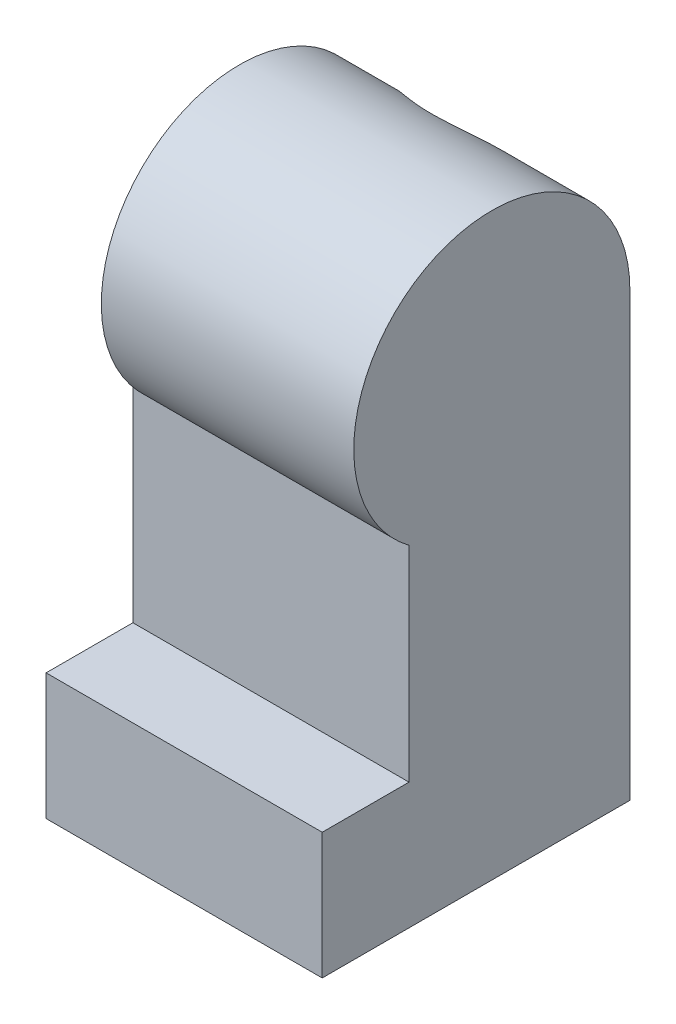
ISO-10303-21;
HEADER;
FILE_DESCRIPTION(('STEP AP214'),'2;1');
FILE_NAME('part.step','',(''),(''),'','','');
FILE_SCHEMA(('AUTOMOTIVE_DESIGN { 1 0 10303 214 1 1 1 1 }'));
ENDSEC;
DATA;
#1=APPLICATION_CONTEXT('core data for automotive mechanical design processes');
#2=APPLICATION_PROTOCOL_DEFINITION('international standard','automotive_design',2000,#1);
#3=PRODUCT_CONTEXT('',#1,'mechanical');
#4=PRODUCT('Part','Part','',(#3));
#5=PRODUCT_RELATED_PRODUCT_CATEGORY('part','',(#4));
#6=PRODUCT_DEFINITION_FORMATION('','',#4);
#7=PRODUCT_DEFINITION_CONTEXT('part definition',#1,'design');
#8=PRODUCT_DEFINITION('design','',#6,#7);
#9=PRODUCT_DEFINITION_SHAPE('','',#8);
#10=(LENGTH_UNIT() NAMED_UNIT(*) SI_UNIT(.MILLI.,.METRE.));
#11=(NAMED_UNIT(*) PLANE_ANGLE_UNIT() SI_UNIT($,.RADIAN.));
#12=(NAMED_UNIT(*) SI_UNIT($,.STERADIAN.) SOLID_ANGLE_UNIT());
#13=UNCERTAINTY_MEASURE_WITH_UNIT(LENGTH_MEASURE(1.E-05),#10,'distance_accuracy_value','');
#14=(GEOMETRIC_REPRESENTATION_CONTEXT(3) GLOBAL_UNCERTAINTY_ASSIGNED_CONTEXT((#13)) GLOBAL_UNIT_ASSIGNED_CONTEXT((#10,
#11,#12)) REPRESENTATION_CONTEXT('',''));
#15=CARTESIAN_POINT('',(0.,0.,0.));
#16=DIRECTION('',(0.,0.,1.));
#17=DIRECTION('',(1.,0.,0.));
#18=AXIS2_PLACEMENT_3D('',#15,#16,#17);
#19=CARTESIAN_POINT('',(-3.5,0.499999999999999,-1.7));
#20=DIRECTION('',(0.,0.,-1.));
#21=DIRECTION('',(0.,1.,0.));
#22=AXIS2_PLACEMENT_3D('',#19,#20,#21);
#23=PLANE('',#22);
#24=DIRECTION('',(-1.,0.,0.));
#25=VECTOR('',#24,1.);
#26=CARTESIAN_POINT('',(0.,2.2,-1.7));
#27=LINE('',#26,#25);
#28=CARTESIAN_POINT('',(-1.80589256539026,2.2,-1.7));
#29=VERTEX_POINT('',#28);
#30=CARTESIAN_POINT('',(-4.50589256539026,2.2,-1.7));
#31=VERTEX_POINT('',#30);
#32=EDGE_CURVE('E64',#29,#31,#27,.T.);
#33=ORIENTED_EDGE('',*,*,#32,.T.);
#34=DIRECTION('',(0.,-1.,0.));
#35=VECTOR('',#34,1.);
#36=CARTESIAN_POINT('',(-4.50589256539026,0.,-1.7));
#37=LINE('',#36,#35);
#38=CARTESIAN_POINT('',(-4.50589256539026,-1.67903192883735,-1.7));
#39=VERTEX_POINT('',#38);
#40=EDGE_CURVE('E186',#31,#39,#37,.T.);
#41=ORIENTED_EDGE('',*,*,#40,.T.);
#42=CARTESIAN_POINT('',(-3.5,0.499999999999999,-1.7));
#43=DIRECTION('',(0.,0.,-1.));
#44=DIRECTION('',(0.,1.,0.));
#45=AXIS2_PLACEMENT_3D('',#42,#43,#44);
#46=CIRCLE('',#45,2.4);
#47=EDGE_CURVE('E206',#39,#29,#46,.T.);
#48=ORIENTED_EDGE('',*,*,#47,.T.);
#49=EDGE_LOOP('',(#33,#41,#48));
#50=FACE_BOUND('',#49,.T.);
#51=ADVANCED_FACE('F43',(#50),#23,.T.);
#52=CARTESIAN_POINT('',(-1.80589256539026,-1.2,-1.7));
#53=VERTEX_POINT('',#52);
#54=EDGE_CURVE('E292',#29,#53,#46,.T.);
#55=ORIENTED_EDGE('',*,*,#54,.T.);
#56=DIRECTION('',(0.,1.,0.));
#57=VECTOR('',#56,1.);
#58=CARTESIAN_POINT('',(-1.80589256539026,0.,-1.7));
#59=LINE('',#58,#57);
#60=EDGE_CURVE('E264',#53,#29,#59,.T.);
#61=ORIENTED_EDGE('',*,*,#60,.T.);
#62=EDGE_LOOP('',(#55,#61));
#63=FACE_BOUND('',#62,.T.);
#64=ADVANCED_FACE('F454',(#63),#23,.T.);
#65=CARTESIAN_POINT('',(0.,-2.3,-2.1));
#66=DIRECTION('',(0.,0.,-1.));
#67=DIRECTION('',(0.,1.,0.));
#68=AXIS2_PLACEMENT_3D('',#65,#66,#67);
#69=PLANE('',#68);
#70=DIRECTION('',(0.,-1.,0.));
#71=VECTOR('',#70,1.);
#72=CARTESIAN_POINT('',(-1.1,-2.3,-2.1));
#73=LINE('',#72,#71);
#74=CARTESIAN_POINT('',(-1.1,-7.3,-2.1));
#75=VERTEX_POINT('',#74);
#76=CARTESIAN_POINT('',(-1.1,-11.2,-2.1));
#77=VERTEX_POINT('',#76);
#78=EDGE_CURVE('E352',#75,#77,#73,.T.);
#79=ORIENTED_EDGE('',*,*,#78,.F.);
#80=CARTESIAN_POINT('',(-3.5,-7.3,-2.1));
#81=DIRECTION('',(0.,0.,-1.));
#82=DIRECTION('',(0.,1.,0.));
#83=AXIS2_PLACEMENT_3D('',#80,#81,#82);
#84=CIRCLE('',#83,2.4);
#85=CARTESIAN_POINT('',(-5.9,-7.3,-2.1));
#86=VERTEX_POINT('',#85);
#87=EDGE_CURVE('E298',#75,#86,#84,.T.);
#88=ORIENTED_EDGE('',*,*,#87,.T.);
#89=DIRECTION('',(0.,-1.,0.));
#90=VECTOR('',#89,1.);
#91=CARTESIAN_POINT('',(-5.9,-2.3,-2.1));
#92=LINE('',#91,#90);
#93=CARTESIAN_POINT('',(-5.9,-11.2,-2.1));
#94=VERTEX_POINT('',#93);
#95=EDGE_CURVE('E366',#86,#94,#92,.T.);
#96=ORIENTED_EDGE('',*,*,#95,.T.);
#97=DIRECTION('',(1.,0.,0.));
#98=VECTOR('',#97,1.);
#99=CARTESIAN_POINT('',(0.,-11.2,-2.1));
#100=LINE('',#99,#98);
#101=EDGE_CURVE('E328',#94,#77,#100,.T.);
#102=ORIENTED_EDGE('',*,*,#101,.T.);
#103=EDGE_LOOP('',(#79,#88,#96,#102));
#104=FACE_BOUND('',#103,.T.);
#105=ADVANCED_FACE('F456',(#104),#69,.F.);
#106=CARTESIAN_POINT('',(-7.,-11.2,0.));
#107=DIRECTION('',(0.,1.,0.));
#108=DIRECTION('',(0.,0.,1.));
#109=AXIS2_PLACEMENT_3D('',#106,#107,#108);
#110=PLANE('',#109);
#111=DIRECTION('',(0.,0.,1.));
#112=VECTOR('',#111,1.);
#113=CARTESIAN_POINT('',(0.,-11.2,0.));
#114=LINE('',#113,#112);
#115=CARTESIAN_POINT('',(0.,-11.2,-3.5));
#116=VERTEX_POINT('',#115);
#117=CARTESIAN_POINT('',(0.,-11.2,4.3));
#118=VERTEX_POINT('',#117);
#119=EDGE_CURVE('E381',#116,#118,#114,.T.);
#120=ORIENTED_EDGE('',*,*,#119,.T.);
#121=DIRECTION('',(1.,0.,0.));
#122=VECTOR('',#121,1.);
#123=CARTESIAN_POINT('',(-7.,-11.2,4.3));
#124=LINE('',#123,#122);
#125=CARTESIAN_POINT('',(-7.,-11.2,4.3));
#126=VERTEX_POINT('',#125);
#127=EDGE_CURVE('E421',#126,#118,#124,.T.);
#128=ORIENTED_EDGE('',*,*,#127,.F.);
#129=DIRECTION('',(0.,0.,1.));
#130=VECTOR('',#129,1.);
#131=CARTESIAN_POINT('',(-7.,-11.2,0.));
#132=LINE('',#131,#130);
#133=CARTESIAN_POINT('',(-7.,-11.2,-3.5));
#134=VERTEX_POINT('',#133);
#135=EDGE_CURVE('E400',#134,#126,#132,.T.);
#136=ORIENTED_EDGE('',*,*,#135,.F.);
#137=DIRECTION('',(1.,0.,0.));
#138=VECTOR('',#137,1.);
#139=CARTESIAN_POINT('',(-7.,-11.2,-3.5));
#140=LINE('',#139,#138);
#141=EDGE_CURVE('E425',#134,#116,#140,.T.);
#142=ORIENTED_EDGE('',*,*,#141,.T.);
#143=EDGE_LOOP('',(#120,#128,#136,#142));
#144=FACE_BOUND('',#143,.T.);
#145=DIRECTION('',(0.,0.,1.));
#146=VECTOR('',#145,1.);
#147=CARTESIAN_POINT('',(-5.9,-11.2,0.));
#148=LINE('',#147,#146);
#149=CARTESIAN_POINT('',(-5.9,-11.2,2.9));
#150=VERTEX_POINT('',#149);
#151=EDGE_CURVE('E335',#94,#150,#148,.T.);
#152=ORIENTED_EDGE('',*,*,#151,.T.);
#153=DIRECTION('',(1.,0.,0.));
#154=VECTOR('',#153,1.);
#155=CARTESIAN_POINT('',(0.,-11.2,2.9));
#156=LINE('',#155,#154);
#157=CARTESIAN_POINT('',(-1.1,-11.2,2.9));
#158=VERTEX_POINT('',#157);
#159=EDGE_CURVE('E303',#150,#158,#156,.T.);
#160=ORIENTED_EDGE('',*,*,#159,.T.);
#161=DIRECTION('',(0.,0.,1.));
#162=VECTOR('',#161,1.);
#163=CARTESIAN_POINT('',(-1.1,-11.2,0.));
#164=LINE('',#163,#162);
#165=EDGE_CURVE('E332',#77,#158,#164,.T.);
#166=ORIENTED_EDGE('',*,*,#165,.F.);
#167=ORIENTED_EDGE('',*,*,#101,.F.);
#168=EDGE_LOOP('',(#152,#160,#166,#167));
#169=FACE_BOUND('',#168,.T.);
#170=ADVANCED_FACE('F461',(#144,#169),#110,.F.);
#171=CARTESIAN_POINT('',(0.,-2.3,1.2));
#172=DIRECTION('',(0.,0.,-1.));
#173=DIRECTION('',(0.,1.,0.));
#174=AXIS2_PLACEMENT_3D('',#171,#172,#173);
#175=PLANE('',#174);
#176=DIRECTION('',(0.,-1.,0.));
#177=VECTOR('',#176,1.);
#178=CARTESIAN_POINT('',(-1.1,-2.3,1.2));
#179=LINE('',#178,#177);
#180=CARTESIAN_POINT('',(-1.1,-2.3,1.2));
#181=VERTEX_POINT('',#180);
#182=CARTESIAN_POINT('',(-1.1,-9.2,1.2));
#183=VERTEX_POINT('',#182);
#184=EDGE_CURVE('E359',#181,#183,#179,.T.);
#185=ORIENTED_EDGE('',*,*,#184,.T.);
#186=DIRECTION('',(1.,0.,0.));
#187=VECTOR('',#186,1.);
#188=CARTESIAN_POINT('',(0.,-9.2,1.2));
#189=LINE('',#188,#187);
#190=CARTESIAN_POINT('',(-5.9,-9.2,1.2));
#191=VERTEX_POINT('',#190);
#192=EDGE_CURVE('E307',#191,#183,#189,.T.);
#193=ORIENTED_EDGE('',*,*,#192,.F.);
#194=DIRECTION('',(0.,-1.,0.));
#195=VECTOR('',#194,1.);
#196=CARTESIAN_POINT('',(-5.9,-2.3,1.2));
#197=LINE('',#196,#195);
#198=CARTESIAN_POINT('',(-5.9,-2.3,1.2));
#199=VERTEX_POINT('',#198);
#200=EDGE_CURVE('E362',#199,#191,#197,.T.);
#201=ORIENTED_EDGE('',*,*,#200,.F.);
#202=DIRECTION('',(1.,0.,0.));
#203=VECTOR('',#202,1.);
#204=CARTESIAN_POINT('',(0.,-2.3,1.2));
#205=LINE('',#204,#203);
#206=EDGE_CURVE('E346',#199,#181,#205,.T.);
#207=ORIENTED_EDGE('',*,*,#206,.T.);
#208=EDGE_LOOP('',(#185,#193,#201,#207));
#209=FACE_BOUND('',#208,.T.);
#210=ADVANCED_FACE('F598',(#209),#175,.T.);
#211=CARTESIAN_POINT('',(-6.4,0.,0.));
#212=DIRECTION('',(1.,0.,0.));
#213=DIRECTION('',(0.,0.,-1.));
#214=AXIS2_PLACEMENT_3D('',#211,#212,#213);
#215=CYLINDRICAL_SURFACE('',#214,3.5);
#216=CARTESIAN_POINT('',(-5.8473389188611,0.,-3.5));
#217=CARTESIAN_POINT('',(-5.85952324799212,0.0571477217374245,-3.50001181867057));
#218=CARTESIAN_POINT('',(-5.86959863933398,0.114743770065322,-3.49860061614223));
#219=CARTESIAN_POINT('',(-5.88551560428378,0.230360407827148,-3.49288728833139));
#220=CARTESIAN_POINT('',(-5.89135828784083,0.288380881929227,-3.48858592151156));
#221=CARTESIAN_POINT('',(-5.8987800738924,0.404089359673819,-3.47707880110764));
#222=CARTESIAN_POINT('',(-5.90038218120077,0.461777456069779,-3.46988896332483));
#223=CARTESIAN_POINT('',(-5.89946378384657,0.576676567862824,-3.45265487837301));
#224=CARTESIAN_POINT('',(-5.89694326407962,0.633887581511211,-3.44261062074615));
#225=CARTESIAN_POINT('',(-5.88336595556229,0.804105036209102,-3.4083356117771));
#226=CARTESIAN_POINT('',(-5.86630384227635,0.915869866292524,-3.37994514796454));
#227=CARTESIAN_POINT('',(-5.8176646602164,1.13314832429677,-3.31344895138059));
#228=CARTESIAN_POINT('',(-5.78607230536925,1.23865523648251,-3.27533300607753));
#229=CARTESIAN_POINT('',(-5.70809491628295,1.44731564674367,-3.18884504357403));
#230=CARTESIAN_POINT('',(-5.66097838899282,1.55000373794561,-3.14001706082533));
#231=CARTESIAN_POINT('',(-5.55467670041225,1.74526360748642,-3.03584021966201));
#232=CARTESIAN_POINT('',(-5.49548649772665,1.83783113507598,-2.98048864139242));
#233=CARTESIAN_POINT('',(-5.35353573776811,2.03018562272158,-2.85379750966277));
#234=CARTESIAN_POINT('',(-5.26842986956987,2.12760502281981,-2.78149734246403));
#235=CARTESIAN_POINT('',(-5.08471660055204,2.30698502977076,-2.63462775579363));
#236=CARTESIAN_POINT('',(-4.98609165576466,2.38892521486053,-2.56005548720432));
#237=CARTESIAN_POINT('',(-4.78326463330636,2.53162908276111,-2.41871956278776));
#238=CARTESIAN_POINT('',(-4.67995301376685,2.59348192527748,-2.3517770338946));
#239=CARTESIAN_POINT('',(-4.46138451080996,2.70240840583052,-2.22572729179699));
#240=CARTESIAN_POINT('',(-4.34615403536233,2.74951382379002,-2.16660339102304));
#241=CARTESIAN_POINT('',(-4.14772757712701,2.81234304649958,-2.08383834027692));
#242=CARTESIAN_POINT('',(-4.06831867472429,2.83323788763357,-2.05514190190293));
#243=CARTESIAN_POINT('',(-3.90499381872968,2.86704539023274,-2.0077106103014));
#244=CARTESIAN_POINT('',(-3.82108827656746,2.87997569256307,-1.98895375460871));
#245=CARTESIAN_POINT('',(-3.64949120839477,2.89690144617537,-1.9642337035912));
#246=CARTESIAN_POINT('',(-3.56176894903616,2.9008005995437,-1.95840842288825));
#247=CARTESIAN_POINT('',(-3.38665261282273,2.89892227463506,-1.96118525247281));
#248=CARTESIAN_POINT('',(-3.2992586376826,2.89314201115589,-1.96979151536346));
#249=CARTESIAN_POINT('',(-3.11997573015766,2.8716013071517,-2.00106904761721));
#250=CARTESIAN_POINT('',(-3.02841815728649,2.85496763238069,-2.02496702821199));
#251=CARTESIAN_POINT('',(-2.85105317430008,2.81241019263363,-2.08366151371945));
#252=CARTESIAN_POINT('',(-2.76526360077856,2.78645905439294,-2.11849009267811));
#253=CARTESIAN_POINT('',(-2.61773079012411,2.73301571417905,-2.18679788954713));
#254=CARTESIAN_POINT('',(-2.55478723431316,2.70705840232988,-2.21895300854012));
#255=CARTESIAN_POINT('',(-2.43253952688268,2.6505953738598,-2.28610481874926));
#256=CARTESIAN_POINT('',(-2.37323749385825,2.62008704424715,-2.32110313711189));
#257=CARTESIAN_POINT('',(-2.20045968614499,2.52207206221611,-2.42868720689749));
#258=CARTESIAN_POINT('',(-2.09218099861509,2.44810107186269,-2.50382746204864));
#259=CARTESIAN_POINT('',(-1.88360823330201,2.27939132717921,-2.65861963929727));
#260=CARTESIAN_POINT('',(-1.78407812901597,2.18373583955496,-2.73829291655651));
#261=CARTESIAN_POINT('',(-1.60137340449738,1.97459276266238,-2.89271972414267));
#262=CARTESIAN_POINT('',(-1.51817479248159,1.86113177857625,-2.96748036225121));
#263=CARTESIAN_POINT('',(-1.38270764696269,1.63641660452186,-3.09615262794246));
#264=CARTESIAN_POINT('',(-1.32762439761678,1.52768128659245,-3.15148910825451));
#265=CARTESIAN_POINT('',(-1.23355837193325,1.29903752936263,-3.25238946581503));
#266=CARTESIAN_POINT('',(-1.19457083515538,1.17913240650188,-3.29795623061859));
#267=CARTESIAN_POINT('',(-1.15017085451829,0.992412245075306,-3.35700281785587));
#268=CARTESIAN_POINT('',(-1.13769076115729,0.928685601014822,-3.37520301505509));
#269=CARTESIAN_POINT('',(-1.11787508897714,0.799562026687033,-3.40809707788925));
#270=CARTESIAN_POINT('',(-1.11053670135105,0.734166028622351,-3.42279285501696));
#271=CARTESIAN_POINT('',(-1.1012748142032,0.602361890112999,-3.44842924317227));
#272=CARTESIAN_POINT('',(-1.09934358386222,0.53595533132392,-3.45937519578144));
#273=CARTESIAN_POINT('',(-1.10104813363846,0.402723056835072,-3.47740236223998));
#274=CARTESIAN_POINT('',(-1.10468020548551,0.335897649885473,-3.4844861461866));
#275=CARTESIAN_POINT('',(-1.1154853741884,0.224046580330871,-3.49311564200003));
#276=CARTESIAN_POINT('',(-1.12113712347402,0.178946589127799,-3.49571088870466));
#277=CARTESIAN_POINT('',(-1.1349923537418,0.0891432677126922,-3.49915350020635));
#278=CARTESIAN_POINT('',(-1.14319194086814,0.0444394385561715,-3.50000351725482));
#279=CARTESIAN_POINT('',(-1.15266108113889,0.,-3.5));
#280=B_SPLINE_CURVE_WITH_KNOTS('',3,(#216,#217,#218,#219,#220,#221,#222,#223,#224,#225,#226,
#227,#228,#229,#230,#231,#232,#233,#234,#235,#236,#237,#238,#239,#240,#241,#242,#243,#244,#245,
#246,#247,#248,#249,#250,#251,#252,#253,#254,#255,#256,#257,#258,#259,#260,#261,#262,#263,#264,
#265,#266,#267,#268,#269,#270,#271,#272,#273,#274,#275,#276,#277,#278,#279),.UNSPECIFIED.,.F.,
.F.,(4,2,2,2,2,2,2,2,2,2,2,2,2,2,2,2,2,2,2,2,2,2,2,2,2,2,2,2,2,2,2,4),(0.,0.175237440381033,
0.35042891134353,0.524668014814338,0.698907756660255,1.04686867533735,1.39519649537508,
1.76309807782818,2.13115359418281,2.57414809278723,3.01772301461145,3.42986501795747,
3.84111266440891,4.10124897819194,4.36080701764205,4.62312019539684,4.88550886538463,
5.17215450827924,5.45964925644542,5.68524281978454,5.91096641102046,6.36265437457839,
6.83912330739456,7.31488695708917,7.71498529590946,8.1149652174138,8.31702682714792,
8.51897796858323,8.720640224955,8.92216811998134,9.05864817270439,9.19492066068158),.UNSPECIFIED.);
#281=CARTESIAN_POINT('',(-5.8473389188611,0.,-3.5));
#282=VERTEX_POINT('',#281);
#283=CARTESIAN_POINT('',(-1.1526610811389,0.,-3.5));
#284=VERTEX_POINT('',#283);
#285=EDGE_CURVE('E71',#282,#284,#280,.T.);
#286=ORIENTED_EDGE('',*,*,#285,.F.);
#287=DIRECTION('',(1.,0.,0.));
#288=VECTOR('',#287,1.);
#289=CARTESIAN_POINT('',(-7.,0.,-3.5));
#290=LINE('',#289,#288);
#291=CARTESIAN_POINT('',(-6.4,0.,-3.5));
#292=VERTEX_POINT('',#291);
#293=EDGE_CURVE('E432',#292,#282,#290,.T.);
#294=ORIENTED_EDGE('',*,*,#293,.F.);
#295=CARTESIAN_POINT('',(-6.4,0.,0.));
#296=DIRECTION('',(1.,0.,0.));
#297=DIRECTION('',(0.,0.,-1.));
#298=AXIS2_PLACEMENT_3D('',#295,#296,#297);
#299=CIRCLE('',#298,3.5);
#300=CARTESIAN_POINT('',(-6.4,-2.8,2.1));
#301=VERTEX_POINT('',#300);
#302=EDGE_CURVE('E12',#292,#301,#299,.T.);
#303=ORIENTED_EDGE('',*,*,#302,.T.);
#304=DIRECTION('',(1.,0.,0.));
#305=VECTOR('',#304,1.);
#306=CARTESIAN_POINT('',(-7.,-2.8,2.1));
#307=LINE('',#306,#305);
#308=CARTESIAN_POINT('',(0.,-2.8,2.1));
#309=VERTEX_POINT('',#308);
#310=EDGE_CURVE('E406',#301,#309,#307,.T.);
#311=ORIENTED_EDGE('',*,*,#310,.T.);
#312=CARTESIAN_POINT('',(0.,0.,0.));
#313=DIRECTION('',(1.,0.,0.));
#314=DIRECTION('',(0.,0.,-1.));
#315=AXIS2_PLACEMENT_3D('',#312,#313,#314);
#316=CIRCLE('',#315,3.5);
#317=CARTESIAN_POINT('',(0.,0.,-3.5));
#318=VERTEX_POINT('',#317);
#319=EDGE_CURVE('E56',#318,#309,#316,.T.);
#320=ORIENTED_EDGE('',*,*,#319,.F.);
#321=EDGE_CURVE('E429',#284,#318,#290,.T.);
#322=ORIENTED_EDGE('',*,*,#321,.F.);
#323=EDGE_LOOP('',(#286,#294,#303,#311,#320,#322));
#324=FACE_BOUND('',#323,.T.);
#325=ADVANCED_FACE('F45',(#324),#215,.T.);
#326=CARTESIAN_POINT('',(-6.4,0.,0.));
#327=DIRECTION('',(1.,0.,0.));
#328=DIRECTION('',(0.,0.,-1.));
#329=AXIS2_PLACEMENT_3D('',#326,#327,#328);
#330=PLANE('',#329);
#331=CARTESIAN_POINT('',(-6.4,0.,0.));
#332=DIRECTION('',(-1.,0.,0.));
#333=DIRECTION('',(0.,0.,1.));
#334=AXIS2_PLACEMENT_3D('',#331,#332,#333);
#335=CIRCLE('',#334,1.125);
#336=CARTESIAN_POINT('',(-6.4,0.,1.125));
#337=VERTEX_POINT('',#336);
#338=EDGE_CURVE('E210',#337,#337,#335,.T.);
#339=ORIENTED_EDGE('',*,*,#338,.F.);
#340=EDGE_LOOP('',(#339));
#341=FACE_BOUND('',#340,.T.);
#342=ORIENTED_EDGE('',*,*,#302,.F.);
#343=CARTESIAN_POINT('',(-6.4,0.,0.));
#344=DIRECTION('',(1.,0.,0.));
#345=DIRECTION('',(0.,0.,-1.));
#346=AXIS2_PLACEMENT_3D('',#343,#344,#345);
#347=CIRCLE('',#346,3.5);
#348=EDGE_CURVE('E439',#301,#292,#347,.T.);
#349=ORIENTED_EDGE('',*,*,#348,.F.);
#350=EDGE_LOOP('',(#342,#349));
#351=FACE_BOUND('',#350,.T.);
#352=ADVANCED_FACE('F515',(#341,#351),#330,.F.);
#353=CARTESIAN_POINT('',(0.,0.,0.));
#354=DIRECTION('',(1.,0.,0.));
#355=DIRECTION('',(0.,0.,-1.));
#356=AXIS2_PLACEMENT_3D('',#353,#354,#355);
#357=PLANE('',#356);
#358=ORIENTED_EDGE('',*,*,#319,.T.);
#359=DIRECTION('',(0.,1.,0.));
#360=VECTOR('',#359,1.);
#361=CARTESIAN_POINT('',(0.,0.,2.1));
#362=LINE('',#361,#360);
#363=CARTESIAN_POINT('',(0.,-8.,2.1));
#364=VERTEX_POINT('',#363);
#365=EDGE_CURVE('E373',#364,#309,#362,.T.);
#366=ORIENTED_EDGE('',*,*,#365,.F.);
#367=DIRECTION('',(0.,0.,-1.));
#368=VECTOR('',#367,1.);
#369=CARTESIAN_POINT('',(0.,-8.,0.));
#370=LINE('',#369,#368);
#371=CARTESIAN_POINT('',(0.,-8.,4.3));
#372=VERTEX_POINT('',#371);
#373=EDGE_CURVE('E375',#372,#364,#370,.T.);
#374=ORIENTED_EDGE('',*,*,#373,.F.);
#375=DIRECTION('',(0.,1.,0.));
#376=VECTOR('',#375,1.);
#377=CARTESIAN_POINT('',(0.,0.,4.29999999999999));
#378=LINE('',#377,#376);
#379=EDGE_CURVE('E378',#118,#372,#378,.T.);
#380=ORIENTED_EDGE('',*,*,#379,.F.);
#381=ORIENTED_EDGE('',*,*,#119,.F.);
#382=DIRECTION('',(0.,-1.,0.));
#383=VECTOR('',#382,1.);
#384=CARTESIAN_POINT('',(0.,0.,-3.5));
#385=LINE('',#384,#383);
#386=EDGE_CURVE('E384',#318,#116,#385,.T.);
#387=ORIENTED_EDGE('',*,*,#386,.F.);
#388=EDGE_LOOP('',(#358,#366,#374,#380,#381,#387));
#389=FACE_BOUND('',#388,.T.);
#390=ADVANCED_FACE('F520',(#389),#357,.T.);
#391=CARTESIAN_POINT('',(-7.,0.,0.));
#392=DIRECTION('',(1.,0.,0.));
#393=DIRECTION('',(0.,0.,-1.));
#394=AXIS2_PLACEMENT_3D('',#391,#392,#393);
#395=CYLINDRICAL_SURFACE('',#394,3.5);
#396=CARTESIAN_POINT('',(-7.,-2.8,2.1));
#397=VERTEX_POINT('',#396);
#398=EDGE_CURVE('E410',#397,#301,#307,.T.);
#399=ORIENTED_EDGE('',*,*,#398,.T.);
#400=ORIENTED_EDGE('',*,*,#348,.T.);
#401=CARTESIAN_POINT('',(-7.,0.,-3.5));
#402=VERTEX_POINT('',#401);
#403=EDGE_CURVE('E434',#402,#292,#290,.T.);
#404=ORIENTED_EDGE('',*,*,#403,.F.);
#405=CARTESIAN_POINT('',(-7.,0.,0.));
#406=DIRECTION('',(1.,0.,0.));
#407=DIRECTION('',(0.,0.,-1.));
#408=AXIS2_PLACEMENT_3D('',#405,#406,#407);
#409=CIRCLE('',#408,3.5);
#410=EDGE_CURVE('E387',#397,#402,#409,.T.);
#411=ORIENTED_EDGE('',*,*,#410,.F.);
#412=EDGE_LOOP('',(#399,#400,#404,#411));
#413=FACE_BOUND('',#412,.T.);
#414=ADVANCED_FACE('F560',(#413),#395,.F.);
#415=CARTESIAN_POINT('',(-7.,0.,-3.5));
#416=DIRECTION('',(0.,0.,1.));
#417=DIRECTION('',(0.,-1.,0.));
#418=AXIS2_PLACEMENT_3D('',#415,#416,#417);
#419=PLANE('',#418);
#420=CARTESIAN_POINT('',(-3.5,-7.3,-3.5));
#421=DIRECTION('',(0.,0.,-1.));
#422=DIRECTION('',(0.,1.,0.));
#423=AXIS2_PLACEMENT_3D('',#420,#421,#422);
#424=CIRCLE('',#423,2.4);
#425=CARTESIAN_POINT('',(-3.5,-4.9,-3.5));
#426=VERTEX_POINT('',#425);
#427=EDGE_CURVE('E197',#426,#426,#424,.T.);
#428=ORIENTED_EDGE('',*,*,#427,.F.);
#429=EDGE_LOOP('',(#428));
#430=FACE_BOUND('',#429,.T.);
#431=ORIENTED_EDGE('',*,*,#293,.T.);
#432=CARTESIAN_POINT('',(-3.5,0.499999999999999,-3.5));
#433=DIRECTION('',(0.,0.,-1.));
#434=DIRECTION('',(0.,1.,0.));
#435=AXIS2_PLACEMENT_3D('',#432,#433,#434);
#436=CIRCLE('',#435,2.4);
#437=EDGE_CURVE('E287',#284,#282,#436,.T.);
#438=ORIENTED_EDGE('',*,*,#437,.F.);
#439=ORIENTED_EDGE('',*,*,#321,.T.);
#440=ORIENTED_EDGE('',*,*,#386,.T.);
#441=ORIENTED_EDGE('',*,*,#141,.F.);
#442=DIRECTION('',(0.,-1.,0.));
#443=VECTOR('',#442,1.);
#444=CARTESIAN_POINT('',(-7.,0.,-3.5));
#445=LINE('',#444,#443);
#446=EDGE_CURVE('E403',#402,#134,#445,.T.);
#447=ORIENTED_EDGE('',*,*,#446,.F.);
#448=ORIENTED_EDGE('',*,*,#403,.T.);
#449=EDGE_LOOP('',(#431,#438,#439,#440,#441,#447,#448));
#450=FACE_BOUND('',#449,.T.);
#451=ADVANCED_FACE('F555',(#430,#450),#419,.F.);
#452=CARTESIAN_POINT('',(-7.,0.,4.29999999999999));
#453=DIRECTION('',(0.,0.,-1.));
#454=DIRECTION('',(0.,1.,0.));
#455=AXIS2_PLACEMENT_3D('',#452,#453,#454);
#456=PLANE('',#455);
#457=ORIENTED_EDGE('',*,*,#379,.T.);
#458=DIRECTION('',(1.,0.,0.));
#459=VECTOR('',#458,1.);
#460=CARTESIAN_POINT('',(-7.,-8.,4.3));
#461=LINE('',#460,#459);
#462=CARTESIAN_POINT('',(-7.,-8.,4.3));
#463=VERTEX_POINT('',#462);
#464=EDGE_CURVE('E417',#463,#372,#461,.T.);
#465=ORIENTED_EDGE('',*,*,#464,.F.);
#466=DIRECTION('',(0.,1.,0.));
#467=VECTOR('',#466,1.);
#468=CARTESIAN_POINT('',(-7.,0.,4.29999999999999));
#469=LINE('',#468,#467);
#470=EDGE_CURVE('E397',#126,#463,#469,.T.);
#471=ORIENTED_EDGE('',*,*,#470,.F.);
#472=ORIENTED_EDGE('',*,*,#127,.T.);
#473=EDGE_LOOP('',(#457,#465,#471,#472));
#474=FACE_BOUND('',#473,.T.);
#475=ADVANCED_FACE('F575',(#474),#456,.F.);
#476=CARTESIAN_POINT('',(-7.,-8.,0.));
#477=DIRECTION('',(0.,-1.,0.));
#478=DIRECTION('',(0.,0.,-1.));
#479=AXIS2_PLACEMENT_3D('',#476,#477,#478);
#480=PLANE('',#479);
#481=ORIENTED_EDGE('',*,*,#373,.T.);
#482=DIRECTION('',(1.,0.,0.));
#483=VECTOR('',#482,1.);
#484=CARTESIAN_POINT('',(-7.,-8.,2.1));
#485=LINE('',#484,#483);
#486=CARTESIAN_POINT('',(-7.,-8.,2.1));
#487=VERTEX_POINT('',#486);
#488=EDGE_CURVE('E414',#487,#364,#485,.T.);
#489=ORIENTED_EDGE('',*,*,#488,.F.);
#490=DIRECTION('',(0.,0.,-1.));
#491=VECTOR('',#490,1.);
#492=CARTESIAN_POINT('',(-7.,-8.,0.));
#493=LINE('',#492,#491);
#494=EDGE_CURVE('E394',#463,#487,#493,.T.);
#495=ORIENTED_EDGE('',*,*,#494,.F.);
#496=ORIENTED_EDGE('',*,*,#464,.T.);
#497=EDGE_LOOP('',(#481,#489,#495,#496));
#498=FACE_BOUND('',#497,.T.);
#499=ADVANCED_FACE('F570',(#498),#480,.F.);
#500=CARTESIAN_POINT('',(-7.,0.,2.1));
#501=DIRECTION('',(0.,0.,-1.));
#502=DIRECTION('',(0.,1.,0.));
#503=AXIS2_PLACEMENT_3D('',#500,#501,#502);
#504=PLANE('',#503);
#505=ORIENTED_EDGE('',*,*,#365,.T.);
#506=ORIENTED_EDGE('',*,*,#310,.F.);
#507=ORIENTED_EDGE('',*,*,#398,.F.);
#508=DIRECTION('',(0.,1.,0.));
#509=VECTOR('',#508,1.);
#510=CARTESIAN_POINT('',(-7.,0.,2.1));
#511=LINE('',#510,#509);
#512=EDGE_CURVE('E391',#487,#397,#511,.T.);
#513=ORIENTED_EDGE('',*,*,#512,.F.);
#514=ORIENTED_EDGE('',*,*,#488,.T.);
#515=EDGE_LOOP('',(#505,#506,#507,#513,#514));
#516=FACE_BOUND('',#515,.T.);
#517=ADVANCED_FACE('F564',(#516),#504,.F.);
#518=CARTESIAN_POINT('',(-7.,0.,0.));
#519=DIRECTION('',(1.,0.,0.));
#520=DIRECTION('',(0.,0.,-1.));
#521=AXIS2_PLACEMENT_3D('',#518,#519,#520);
#522=PLANE('',#521);
#523=ORIENTED_EDGE('',*,*,#410,.T.);
#524=ORIENTED_EDGE('',*,*,#446,.T.);
#525=ORIENTED_EDGE('',*,*,#135,.T.);
#526=ORIENTED_EDGE('',*,*,#470,.T.);
#527=ORIENTED_EDGE('',*,*,#494,.T.);
#528=ORIENTED_EDGE('',*,*,#512,.T.);
#529=EDGE_LOOP('',(#523,#524,#525,#526,#527,#528));
#530=FACE_BOUND('',#529,.T.);
#531=ADVANCED_FACE('F581',(#530),#522,.F.);
#532=CARTESIAN_POINT('',(-5.9,-2.3,-2.1));
#533=VERTEX_POINT('',#532);
#534=EDGE_CURVE('E369',#533,#86,#92,.T.);
#535=ORIENTED_EDGE('',*,*,#534,.T.);
#536=EDGE_CURVE('E295',#86,#75,#84,.T.);
#537=ORIENTED_EDGE('',*,*,#536,.T.);
#538=CARTESIAN_POINT('',(-1.1,-2.3,-2.1));
#539=VERTEX_POINT('',#538);
#540=EDGE_CURVE('E355',#539,#75,#73,.T.);
#541=ORIENTED_EDGE('',*,*,#540,.F.);
#542=DIRECTION('',(1.,0.,0.));
#543=VECTOR('',#542,1.);
#544=CARTESIAN_POINT('',(0.,-2.3,-2.1));
#545=LINE('',#544,#543);
#546=EDGE_CURVE('E338',#533,#539,#545,.T.);
#547=ORIENTED_EDGE('',*,*,#546,.F.);
#548=EDGE_LOOP('',(#535,#537,#541,#547));
#549=FACE_BOUND('',#548,.T.);
#550=ADVANCED_FACE('F464',(#549),#69,.F.);
#551=CARTESIAN_POINT('',(-5.9,-2.3,0.));
#552=DIRECTION('',(1.,0.,0.));
#553=DIRECTION('',(0.,0.,-1.));
#554=AXIS2_PLACEMENT_3D('',#551,#552,#553);
#555=PLANE('',#554);
#556=ORIENTED_EDGE('',*,*,#95,.F.);
#557=ORIENTED_EDGE('',*,*,#534,.F.);
#558=DIRECTION('',(0.,0.,1.));
#559=VECTOR('',#558,1.);
#560=CARTESIAN_POINT('',(-5.9,-2.3,0.));
#561=LINE('',#560,#559);
#562=EDGE_CURVE('E349',#533,#199,#561,.T.);
#563=ORIENTED_EDGE('',*,*,#562,.T.);
#564=ORIENTED_EDGE('',*,*,#200,.T.);
#565=DIRECTION('',(0.,0.,1.));
#566=VECTOR('',#565,1.);
#567=CARTESIAN_POINT('',(-5.9,-9.2,0.));
#568=LINE('',#567,#566);
#569=CARTESIAN_POINT('',(-5.9,-9.2,2.9));
#570=VERTEX_POINT('',#569);
#571=EDGE_CURVE('E317',#191,#570,#568,.T.);
#572=ORIENTED_EDGE('',*,*,#571,.T.);
#573=DIRECTION('',(0.,-1.,0.));
#574=VECTOR('',#573,1.);
#575=CARTESIAN_POINT('',(-5.9,-9.2,2.9));
#576=LINE('',#575,#574);
#577=EDGE_CURVE('E324',#570,#150,#576,.T.);
#578=ORIENTED_EDGE('',*,*,#577,.T.);
#579=ORIENTED_EDGE('',*,*,#151,.F.);
#580=EDGE_LOOP('',(#556,#557,#563,#564,#572,#578,#579));
#581=FACE_BOUND('',#580,.T.);
#582=ADVANCED_FACE('F588',(#581),#555,.T.);
#583=CARTESIAN_POINT('',(-1.1,-2.3,0.));
#584=DIRECTION('',(1.,0.,0.));
#585=DIRECTION('',(0.,0.,-1.));
#586=AXIS2_PLACEMENT_3D('',#583,#584,#585);
#587=PLANE('',#586);
#588=ORIENTED_EDGE('',*,*,#540,.T.);
#589=ORIENTED_EDGE('',*,*,#78,.T.);
#590=ORIENTED_EDGE('',*,*,#165,.T.);
#591=DIRECTION('',(0.,-1.,0.));
#592=VECTOR('',#591,1.);
#593=CARTESIAN_POINT('',(-1.1,-9.2,2.9));
#594=LINE('',#593,#592);
#595=CARTESIAN_POINT('',(-1.1,-9.2,2.9));
#596=VERTEX_POINT('',#595);
#597=EDGE_CURVE('E320',#596,#158,#594,.T.);
#598=ORIENTED_EDGE('',*,*,#597,.F.);
#599=DIRECTION('',(0.,0.,1.));
#600=VECTOR('',#599,1.);
#601=CARTESIAN_POINT('',(-1.1,-9.2,0.));
#602=LINE('',#601,#600);
#603=EDGE_CURVE('E310',#183,#596,#602,.T.);
#604=ORIENTED_EDGE('',*,*,#603,.F.);
#605=ORIENTED_EDGE('',*,*,#184,.F.);
#606=DIRECTION('',(0.,0.,1.));
#607=VECTOR('',#606,1.);
#608=CARTESIAN_POINT('',(-1.1,-2.3,0.));
#609=LINE('',#608,#607);
#610=EDGE_CURVE('E342',#539,#181,#609,.T.);
#611=ORIENTED_EDGE('',*,*,#610,.F.);
#612=EDGE_LOOP('',(#588,#589,#590,#598,#604,#605,#611));
#613=FACE_BOUND('',#612,.T.);
#614=ADVANCED_FACE('F644',(#613),#587,.F.);
#615=CARTESIAN_POINT('',(0.,-2.3,0.));
#616=DIRECTION('',(0.,-1.,0.));
#617=DIRECTION('',(0.,0.,-1.));
#618=AXIS2_PLACEMENT_3D('',#615,#616,#617);
#619=PLANE('',#618);
#620=ORIENTED_EDGE('',*,*,#546,.T.);
#621=ORIENTED_EDGE('',*,*,#610,.T.);
#622=ORIENTED_EDGE('',*,*,#206,.F.);
#623=ORIENTED_EDGE('',*,*,#562,.F.);
#624=EDGE_LOOP('',(#620,#621,#622,#623));
#625=FACE_BOUND('',#624,.T.);
#626=ADVANCED_FACE('F638',(#625),#619,.T.);
#627=CARTESIAN_POINT('',(0.,-9.2,2.9));
#628=DIRECTION('',(0.,0.,-1.));
#629=DIRECTION('',(0.,1.,0.));
#630=AXIS2_PLACEMENT_3D('',#627,#628,#629);
#631=PLANE('',#630);
#632=ORIENTED_EDGE('',*,*,#159,.F.);
#633=ORIENTED_EDGE('',*,*,#577,.F.);
#634=DIRECTION('',(1.,0.,0.));
#635=VECTOR('',#634,1.);
#636=CARTESIAN_POINT('',(0.,-9.2,2.9));
#637=LINE('',#636,#635);
#638=EDGE_CURVE('E314',#570,#596,#637,.T.);
#639=ORIENTED_EDGE('',*,*,#638,.T.);
#640=ORIENTED_EDGE('',*,*,#597,.T.);
#641=EDGE_LOOP('',(#632,#633,#639,#640));
#642=FACE_BOUND('',#641,.T.);
#643=ADVANCED_FACE('F643',(#642),#631,.T.);
#644=CARTESIAN_POINT('',(0.,-9.2,0.));
#645=DIRECTION('',(0.,-1.,0.));
#646=DIRECTION('',(0.,0.,-1.));
#647=AXIS2_PLACEMENT_3D('',#644,#645,#646);
#648=PLANE('',#647);
#649=ORIENTED_EDGE('',*,*,#192,.T.);
#650=ORIENTED_EDGE('',*,*,#603,.T.);
#651=ORIENTED_EDGE('',*,*,#638,.F.);
#652=ORIENTED_EDGE('',*,*,#571,.F.);
#653=EDGE_LOOP('',(#649,#650,#651,#652));
#654=FACE_BOUND('',#653,.T.);
#655=ADVANCED_FACE('F672',(#654),#648,.T.);
#656=CARTESIAN_POINT('',(-3.5,-7.3,-1.7));
#657=DIRECTION('',(0.,0.,-1.));
#658=DIRECTION('',(0.,1.,0.));
#659=AXIS2_PLACEMENT_3D('',#656,#657,#658);
#660=CYLINDRICAL_SURFACE('',#659,2.4);
#661=ORIENTED_EDGE('',*,*,#427,.T.);
#662=EDGE_LOOP('',(#661));
#663=FACE_BOUND('',#662,.T.);
#664=ORIENTED_EDGE('',*,*,#536,.F.);
#665=ORIENTED_EDGE('',*,*,#87,.F.);
#666=EDGE_LOOP('',(#664,#665));
#667=FACE_BOUND('',#666,.T.);
#668=ADVANCED_FACE('F474',(#663,#667),#660,.F.);
#669=CARTESIAN_POINT('',(-3.5,0.499999999999999,-1.7));
#670=DIRECTION('',(0.,0.,-1.));
#671=DIRECTION('',(0.,1.,0.));
#672=AXIS2_PLACEMENT_3D('',#669,#670,#671);
#673=CYLINDRICAL_SURFACE('',#672,2.4);
#674=ORIENTED_EDGE('',*,*,#285,.T.);
#675=ORIENTED_EDGE('',*,*,#437,.T.);
#676=EDGE_LOOP('',(#674,#675));
#677=FACE_BOUND('',#676,.T.);
#678=ORIENTED_EDGE('',*,*,#54,.F.);
#679=ORIENTED_EDGE('',*,*,#47,.F.);
#680=DIRECTION('',(0.,0.,-1.));
#681=VECTOR('',#680,1.);
#682=CARTESIAN_POINT('',(-4.50589256539026,-1.67903192883735,6.701));
#683=LINE('',#682,#681);
#684=CARTESIAN_POINT('',(-4.50589256539026,-1.67903192883735,1.57189432912799));
#685=VERTEX_POINT('',#684);
#686=EDGE_CURVE('E192',#685,#39,#683,.T.);
#687=ORIENTED_EDGE('',*,*,#686,.F.);
#688=CARTESIAN_POINT('',(-4.03329166503894,-1.84,1.38));
#689=CARTESIAN_POINT('',(-4.07514375786781,-1.83045975727594,1.39272341654453));
#690=CARTESIAN_POINT('',(-4.116396567173,-1.81987920856244,1.40655351959038));
#691=CARTESIAN_POINT('',(-4.19755767122537,-1.79677805251896,1.43594367086238));
#692=CARTESIAN_POINT('',(-4.23747010834031,-1.78426425445949,1.45149759511151));
#693=CARTESIAN_POINT('',(-4.31608590615937,-1.75737242312822,1.48394268682891));
#694=CARTESIAN_POINT('',(-4.35478948242254,-1.74299472460176,1.50083361396787));
#695=CARTESIAN_POINT('',(-4.43115457838779,-1.71238447403466,1.53567007040377));
#696=CARTESIAN_POINT('',(-4.46881203397668,-1.69614568268615,1.55361904301443));
#697=CARTESIAN_POINT('',(-4.50589256539026,-1.67903192883735,1.57189432912799));
#698=B_SPLINE_CURVE_WITH_KNOTS('',3,(#688,#689,#690,#691,#692,#693,#694,#695,#696,#697),
.UNSPECIFIED.,.F.,.F.,(4,2,2,2,4),(0.,0.134250868332405,0.268039229193863,0.401803595668823,
0.536030302118032),.UNSPECIFIED.);
#699=CARTESIAN_POINT('',(-4.03329166503894,-1.84,1.38));
#700=VERTEX_POINT('',#699);
#701=EDGE_CURVE('E224',#700,#685,#698,.T.);
#702=ORIENTED_EDGE('',*,*,#701,.F.);
#703=CARTESIAN_POINT('',(-3.5,0.499999999999999,1.38));
#704=DIRECTION('',(0.,0.,1.));
#705=DIRECTION('',(-0.222204860432892,-0.974999999999999,0.));
#706=AXIS2_PLACEMENT_3D('',#703,#704,#705);
#707=CIRCLE('',#706,2.4);
#708=CARTESIAN_POINT('',(-2.96670833496106,-1.84,1.38));
#709=VERTEX_POINT('',#708);
#710=EDGE_CURVE('E209',#700,#709,#707,.T.);
#711=ORIENTED_EDGE('',*,*,#710,.T.);
#712=CARTESIAN_POINT('',(-1.80589256539026,-1.2,1.96214168703486));
#713=CARTESIAN_POINT('',(-1.8581123503325,-1.25200974738039,1.93034342687488));
#714=CARTESIAN_POINT('',(-1.91231522101507,-1.3012607143764,1.89737290013413));
#715=CARTESIAN_POINT('',(-2.02451821884151,-1.39427857563876,1.83010183875141));
#716=CARTESIAN_POINT('',(-2.08251972294991,-1.43804346432022,1.79580082367912));
#717=CARTESIAN_POINT('',(-2.20073120665786,-1.51913703482202,1.72770382984711));
#718=CARTESIAN_POINT('',(-2.26085920222232,-1.5565910559543,1.69391449210442));
#719=CARTESIAN_POINT('',(-2.38452268454705,-1.62620388782075,1.62720223933702));
#720=CARTESIAN_POINT('',(-2.4480568151546,-1.65836478555715,1.5942789871499));
#721=CARTESIAN_POINT('',(-2.58414275014103,-1.71973972043444,1.52796699449234));
#722=CARTESIAN_POINT('',(-2.65700475643722,-1.74848452080668,1.49476829380877));
#723=CARTESIAN_POINT('',(-2.80801118695718,-1.79946266655315,1.43304186301554));
#724=CARTESIAN_POINT('',(-2.88621062245503,-1.82160936127315,1.40457829033614));
#725=CARTESIAN_POINT('',(-2.96670833496106,-1.84,1.38));
#726=B_SPLINE_CURVE_WITH_KNOTS('',3,(#712,#713,#714,#715,#716,#717,#718,#719,#720,#721,#722,
#723,#724,#725),.UNSPECIFIED.,.F.,.F.,(4,2,2,2,2,2,4),(0.,0.24067892450024,0.481445580692789,
0.71664963719105,0.951760732793329,1.20647363040686,1.464397417011),.UNSPECIFIED.);
#727=CARTESIAN_POINT('',(-1.80589256539026,-1.2,1.96214168703486));
#728=VERTEX_POINT('',#727);
#729=EDGE_CURVE('E204',#728,#709,#726,.T.);
#730=ORIENTED_EDGE('',*,*,#729,.F.);
#731=DIRECTION('',(0.,0.,-1.));
#732=VECTOR('',#731,1.);
#733=CARTESIAN_POINT('',(-1.80589256539026,-1.2,6.701));
#734=LINE('',#733,#732);
#735=EDGE_CURVE('E267',#728,#53,#734,.T.);
#736=ORIENTED_EDGE('',*,*,#735,.T.);
#737=EDGE_LOOP('',(#678,#679,#687,#702,#711,#730,#736));
#738=FACE_BOUND('',#737,.T.);
#739=ADVANCED_FACE('F249',(#677,#738),#673,.F.);
#740=CARTESIAN_POINT('',(-6.4,0.,0.));
#741=DIRECTION('',(1.,0.,0.));
#742=DIRECTION('',(0.,0.,-1.));
#743=AXIS2_PLACEMENT_3D('',#740,#741,#742);
#744=CYLINDRICAL_SURFACE('',#743,2.3);
#745=ORIENTED_EDGE('',*,*,#701,.T.);
#746=CARTESIAN_POINT('',(-4.50589256539026,0.,0.));
#747=DIRECTION('',(1.,0.,0.));
#748=DIRECTION('',(0.,1.,0.));
#749=AXIS2_PLACEMENT_3D('',#746,#747,#748);
#750=CIRCLE('',#749,2.3);
#751=CARTESIAN_POINT('',(-4.50589256539026,2.2,0.670820393249941));
#752=VERTEX_POINT('',#751);
#753=EDGE_CURVE('E271',#752,#685,#750,.T.);
#754=ORIENTED_EDGE('',*,*,#753,.F.);
#755=DIRECTION('',(1.,0.,0.));
#756=VECTOR('',#755,1.);
#757=CARTESIAN_POINT('',(-6.4,2.2,0.670820393249941));
#758=LINE('',#757,#756);
#759=CARTESIAN_POINT('',(-1.80589256539026,2.2,0.670820393249941));
#760=VERTEX_POINT('',#759);
#761=EDGE_CURVE('E202',#760,#752,#758,.F.);
#762=ORIENTED_EDGE('',*,*,#761,.F.);
#763=CARTESIAN_POINT('',(-1.80589256539026,0.,0.));
#764=DIRECTION('',(-1.,0.,0.));
#765=DIRECTION('',(0.,0.,1.));
#766=AXIS2_PLACEMENT_3D('',#763,#764,#765);
#767=CIRCLE('',#766,2.3);
#768=EDGE_CURVE('E215',#728,#760,#767,.T.);
#769=ORIENTED_EDGE('',*,*,#768,.F.);
#770=ORIENTED_EDGE('',*,*,#729,.T.);
#771=ORIENTED_EDGE('',*,*,#710,.F.);
#772=EDGE_LOOP('',(#745,#754,#762,#769,#770,#771));
#773=FACE_BOUND('',#772,.T.);
#774=ADVANCED_FACE('F244',(#773),#744,.F.);
#775=CARTESIAN_POINT('',(0.,2.2,6.701));
#776=DIRECTION('',(0.,-1.,0.));
#777=DIRECTION('',(0.,0.,-1.));
#778=AXIS2_PLACEMENT_3D('',#775,#776,#777);
#779=PLANE('',#778);
#780=DIRECTION('',(0.,0.,-1.));
#781=VECTOR('',#780,1.);
#782=CARTESIAN_POINT('',(-1.80589256539026,2.2,6.701));
#783=LINE('',#782,#781);
#784=EDGE_CURVE('E272',#760,#29,#783,.T.);
#785=ORIENTED_EDGE('',*,*,#784,.F.);
#786=ORIENTED_EDGE('',*,*,#761,.T.);
#787=DIRECTION('',(0.,0.,-1.));
#788=VECTOR('',#787,1.);
#789=CARTESIAN_POINT('',(-4.50589256539026,2.2,6.701));
#790=LINE('',#789,#788);
#791=EDGE_CURVE('E189',#752,#31,#790,.T.);
#792=ORIENTED_EDGE('',*,*,#791,.T.);
#793=ORIENTED_EDGE('',*,*,#32,.F.);
#794=EDGE_LOOP('',(#785,#786,#792,#793));
#795=FACE_BOUND('',#794,.T.);
#796=ADVANCED_FACE('F200',(#795),#779,.T.);
#797=CARTESIAN_POINT('',(-1.80589256539026,0.,6.701));
#798=DIRECTION('',(-1.,0.,0.));
#799=DIRECTION('',(0.,0.,1.));
#800=AXIS2_PLACEMENT_3D('',#797,#798,#799);
#801=PLANE('',#800);
#802=ORIENTED_EDGE('',*,*,#60,.F.);
#803=ORIENTED_EDGE('',*,*,#735,.F.);
#804=ORIENTED_EDGE('',*,*,#768,.T.);
#805=ORIENTED_EDGE('',*,*,#784,.T.);
#806=EDGE_LOOP('',(#802,#803,#804,#805));
#807=FACE_BOUND('',#806,.T.);
#808=ADVANCED_FACE('F452',(#807),#801,.T.);
#809=CARTESIAN_POINT('',(-4.50589256539026,0.,6.701));
#810=DIRECTION('',(1.,0.,0.));
#811=DIRECTION('',(0.,1.,0.));
#812=AXIS2_PLACEMENT_3D('',#809,#810,#811);
#813=PLANE('',#812);
#814=CARTESIAN_POINT('',(-4.50589256539026,0.,0.));
#815=DIRECTION('',(1.,0.,0.));
#816=DIRECTION('',(0.,1.,0.));
#817=AXIS2_PLACEMENT_3D('',#814,#815,#816);
#818=CIRCLE('',#817,1.125);
#819=CARTESIAN_POINT('',(-4.50589256539026,0.,1.125));
#820=VERTEX_POINT('',#819);
#821=EDGE_CURVE('E217',#820,#820,#818,.F.);
#822=ORIENTED_EDGE('',*,*,#821,.T.);
#823=EDGE_LOOP('',(#822));
#824=FACE_BOUND('',#823,.T.);
#825=ORIENTED_EDGE('',*,*,#753,.T.);
#826=ORIENTED_EDGE('',*,*,#686,.T.);
#827=ORIENTED_EDGE('',*,*,#40,.F.);
#828=ORIENTED_EDGE('',*,*,#791,.F.);
#829=EDGE_LOOP('',(#825,#826,#827,#828));
#830=FACE_BOUND('',#829,.T.);
#831=ADVANCED_FACE('F188',(#824,#830),#813,.T.);
#832=CARTESIAN_POINT('',(0.00100000000000013,0.,0.));
#833=DIRECTION('',(-1.,0.,0.));
#834=DIRECTION('',(0.,0.,1.));
#835=AXIS2_PLACEMENT_3D('',#832,#833,#834);
#836=CYLINDRICAL_SURFACE('',#835,1.125);
#837=CARTESIAN_POINT('',(-4.50589256539026,0.,1.125));
#838=CARTESIAN_POINT('',(-4.52562285116744,0.,1.125));
#839=CARTESIAN_POINT('',(-4.54535313694463,0.,1.125));
#840=CARTESIAN_POINT('',(-4.584813708499,0.,1.125));
#841=CARTESIAN_POINT('',(-4.60454399427618,0.,1.125));
#842=CARTESIAN_POINT('',(-4.64400456583055,0.,1.125));
#843=CARTESIAN_POINT('',(-4.66373485160774,0.,1.125));
#844=CARTESIAN_POINT('',(-4.70319542316211,0.,1.125));
#845=CARTESIAN_POINT('',(-4.72292570893929,0.,1.125));
#846=CARTESIAN_POINT('',(-4.76238628049366,0.,1.125));
#847=CARTESIAN_POINT('',(-4.78211656627085,0.,1.125));
#848=CARTESIAN_POINT('',(-4.82157713782522,0.,1.125));
#849=CARTESIAN_POINT('',(-4.8413074236024,0.,1.125));
#850=CARTESIAN_POINT('',(-4.88076799515677,0.,1.125));
#851=CARTESIAN_POINT('',(-4.90049828093396,0.,1.125));
#852=CARTESIAN_POINT('',(-4.93995885248832,0.,1.125));
#853=CARTESIAN_POINT('',(-4.95968913826551,0.,1.125));
#854=CARTESIAN_POINT('',(-4.99914970981988,0.,1.125));
#855=CARTESIAN_POINT('',(-5.01887999559706,0.,1.125));
#856=CARTESIAN_POINT('',(-5.05834056715143,0.,1.125));
#857=CARTESIAN_POINT('',(-5.07807085292862,0.,1.125));
#858=CARTESIAN_POINT('',(-5.11753142448299,0.,1.125));
#859=CARTESIAN_POINT('',(-5.13726171026017,0.,1.125));
#860=CARTESIAN_POINT('',(-5.17672228181454,0.,1.125));
#861=CARTESIAN_POINT('',(-5.19645256759173,0.,1.125));
#862=CARTESIAN_POINT('',(-5.2359131391461,0.,1.125));
#863=CARTESIAN_POINT('',(-5.25564342492328,0.,1.125));
#864=CARTESIAN_POINT('',(-5.29510399647765,0.,1.125));
#865=CARTESIAN_POINT('',(-5.31483428225483,0.,1.125));
#866=CARTESIAN_POINT('',(-5.35429485380921,0.,1.125));
#867=CARTESIAN_POINT('',(-5.37402513958639,0.,1.125));
#868=CARTESIAN_POINT('',(-5.41348571114076,0.,1.125));
#869=CARTESIAN_POINT('',(-5.43321599691794,0.,1.125));
#870=CARTESIAN_POINT('',(-5.47267656847231,0.,1.125));
#871=CARTESIAN_POINT('',(-5.4924068542495,0.,1.125));
#872=CARTESIAN_POINT('',(-5.53186742580387,0.,1.125));
#873=CARTESIAN_POINT('',(-5.55159771158105,0.,1.125));
#874=CARTESIAN_POINT('',(-5.59105828313542,0.,1.125));
#875=CARTESIAN_POINT('',(-5.61078856891261,0.,1.125));
#876=CARTESIAN_POINT('',(-5.65024914046698,0.,1.125));
#877=CARTESIAN_POINT('',(-5.66997942624416,0.,1.125));
#878=CARTESIAN_POINT('',(-5.70943999779853,0.,1.125));
#879=CARTESIAN_POINT('',(-5.72917028357572,0.,1.125));
#880=CARTESIAN_POINT('',(-5.76863085513009,0.,1.125));
#881=CARTESIAN_POINT('',(-5.78836114090727,0.,1.125));
#882=CARTESIAN_POINT('',(-5.82782171246164,0.,1.125));
#883=CARTESIAN_POINT('',(-5.84755199823883,0.,1.125));
#884=CARTESIAN_POINT('',(-5.8870125697932,0.,1.125));
#885=CARTESIAN_POINT('',(-5.90674285557038,0.,1.125));
#886=CARTESIAN_POINT('',(-5.94620342712475,0.,1.125));
#887=CARTESIAN_POINT('',(-5.96593371290193,0.,1.125));
#888=CARTESIAN_POINT('',(-6.0053942844563,0.,1.125));
#889=CARTESIAN_POINT('',(-6.02512457023349,0.,1.125));
#890=CARTESIAN_POINT('',(-6.06458514178786,0.,1.125));
#891=CARTESIAN_POINT('',(-6.08431542756504,0.,1.125));
#892=CARTESIAN_POINT('',(-6.12377599911941,0.,1.125));
#893=CARTESIAN_POINT('',(-6.1435062848966,0.,1.125));
#894=CARTESIAN_POINT('',(-6.18296685645097,0.,1.125));
#895=CARTESIAN_POINT('',(-6.20269714222815,0.,1.125));
#896=CARTESIAN_POINT('',(-6.24215771378252,0.,1.125));
#897=CARTESIAN_POINT('',(-6.26188799955971,0.,1.125));
#898=CARTESIAN_POINT('',(-6.30134857111408,0.,1.125));
#899=CARTESIAN_POINT('',(-6.32107885689126,0.,1.125));
#900=CARTESIAN_POINT('',(-6.36053942844563,0.,1.125));
#901=CARTESIAN_POINT('',(-6.38026971422281,0.,1.125));
#902=CARTESIAN_POINT('',(-6.4,0.,1.125));
#903=B_SPLINE_CURVE_WITH_KNOTS('',3,(#837,#838,#839,#840,#841,#842,#843,#844,#845,#846,#847,
#848,#849,#850,#851,#852,#853,#854,#855,#856,#857,#858,#859,#860,#861,#862,#863,#864,#865,#866,
#867,#868,#869,#870,#871,#872,#873,#874,#875,#876,#877,#878,#879,#880,#881,#882,#883,#884,#885,
#886,#887,#888,#889,#890,#891,#892,#893,#894,#895,#896,#897,#898,#899,#900,#901,#902),
.UNSPECIFIED.,.F.,.F.,(4,2,2,2,2,2,2,2,2,2,2,2,2,2,2,2,2,2,2,2,2,2,2,2,2,2,2,2,2,2,2,2,4),(0.,
0.0591908573315545,0.118381714663109,0.177572571994663,0.236763429326218,0.295954286657772,
0.355145143989327,0.414336001320881,0.473526858652436,0.532717715983989,0.591908573315544,
0.651099430647098,0.710290287978653,0.769481145310207,0.828672002641762,0.887862859973316,
0.947053717304871,1.00624457463643,1.06543543196798,1.12462628929953,1.18381714663109,
1.24300800396264,1.3021988612942,1.36138971862575,1.42058057595731,1.47977143328886,
1.53896229062041,1.59815314795197,1.65734400528352,1.71653486261508,1.77572571994663,
1.83491657727819,1.89410743460974),.UNSPECIFIED.);
#904=EDGE_CURVE('BSEAM532',#820,#337,#903,.T.);
#905=ORIENTED_EDGE('',*,*,#821,.F.);
#906=ORIENTED_EDGE('',*,*,#338,.T.);
#907=ORIENTED_EDGE('',*,*,#904,.T.);
#908=ORIENTED_EDGE('',*,*,#904,.F.);
#909=EDGE_LOOP('',(#905,#907,#906,#908));
#910=FACE_BOUND('',#909,.T.);
#911=ADVANCED_FACE('F532',(#910),#836,.F.);
#912=CLOSED_SHELL('',(#51,#64,#105,#170,#210,#325,#352,#390,#414,#451,#475,#499,#517,#531,#550,
#582,#614,#626,#643,#655,#668,#739,#774,#796,#808,#831,#911));
#913=MANIFOLD_SOLID_BREP('B2',#912);
#914=ADVANCED_BREP_SHAPE_REPRESENTATION('',(#18,#913),#14);
#915=SHAPE_DEFINITION_REPRESENTATION(#9,#914);
ENDSEC;
END-ISO-10303-21;
